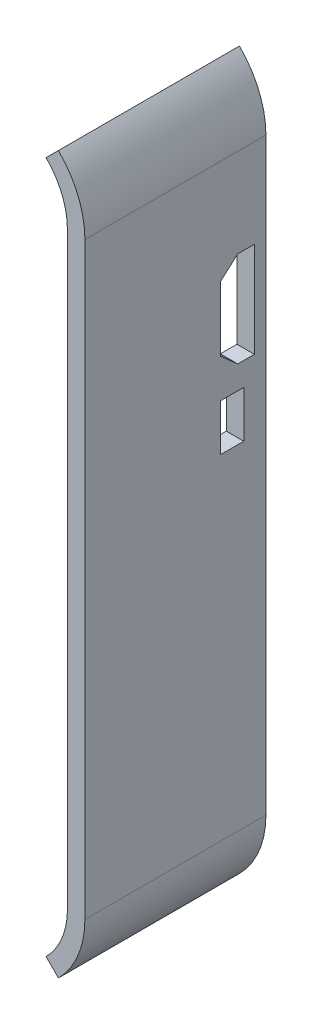
ISO-10303-21;
HEADER;
FILE_DESCRIPTION(('STEP AP214'),'2;1');
FILE_NAME('part.step','',(''),(''),'','','');
FILE_SCHEMA(('AUTOMOTIVE_DESIGN { 1 0 10303 214 1 1 1 1 }'));
ENDSEC;
DATA;
#1=APPLICATION_CONTEXT('core data for automotive mechanical design processes');
#2=APPLICATION_PROTOCOL_DEFINITION('international standard','automotive_design',2000,#1);
#3=PRODUCT_CONTEXT('',#1,'mechanical');
#4=PRODUCT('Part','Part','',(#3));
#5=PRODUCT_RELATED_PRODUCT_CATEGORY('part','',(#4));
#6=PRODUCT_DEFINITION_FORMATION('','',#4);
#7=PRODUCT_DEFINITION_CONTEXT('part definition',#1,'design');
#8=PRODUCT_DEFINITION('design','',#6,#7);
#9=PRODUCT_DEFINITION_SHAPE('','',#8);
#10=(LENGTH_UNIT() NAMED_UNIT(*) SI_UNIT(.MILLI.,.METRE.));
#11=(NAMED_UNIT(*) PLANE_ANGLE_UNIT() SI_UNIT($,.RADIAN.));
#12=(NAMED_UNIT(*) SI_UNIT($,.STERADIAN.) SOLID_ANGLE_UNIT());
#13=UNCERTAINTY_MEASURE_WITH_UNIT(LENGTH_MEASURE(1.E-05),#10,'distance_accuracy_value','');
#14=(GEOMETRIC_REPRESENTATION_CONTEXT(3) GLOBAL_UNCERTAINTY_ASSIGNED_CONTEXT((#13)) GLOBAL_UNIT_ASSIGNED_CONTEXT((#10,
#11,#12)) REPRESENTATION_CONTEXT('',''));
#15=CARTESIAN_POINT('',(0.,0.,0.));
#16=DIRECTION('',(0.,0.,1.));
#17=DIRECTION('',(1.,0.,0.));
#18=AXIS2_PLACEMENT_3D('',#15,#16,#17);
#19=CARTESIAN_POINT('',(21.4174971109602,36.9114971109601,-15.773));
#20=DIRECTION('',(0.,0.,1.));
#21=DIRECTION('',(-0.707106781186551,-0.707106781186544,0.));
#22=AXIS2_PLACEMENT_3D('',#19,#20,#21);
#23=PLANE('',#22);
#24=DIRECTION('',(-0.707106781186551,-0.707106781186544,0.));
#25=VECTOR('',#24,1.);
#26=CARTESIAN_POINT('',(15.7887485554801,31.28274855548,-15.773));
#27=LINE('',#26,#25);
#28=CARTESIAN_POINT('',(15.7277587950629,31.2217587950628,-15.773));
#29=VERTEX_POINT('',#28);
#30=CARTESIAN_POINT('',(14.6501280605346,30.1441280605345,-15.773));
#31=VERTEX_POINT('',#30);
#32=EDGE_CURVE('E266',#29,#31,#27,.T.);
#33=ORIENTED_EDGE('',*,*,#32,.F.);
#34=CARTESIAN_POINT('',(10.16,25.654,-15.773));
#35=DIRECTION('',(0.,0.,1.));
#36=DIRECTION('',(0.,-1.,0.));
#37=AXIS2_PLACEMENT_3D('',#34,#35,#36);
#38=CIRCLE('',#37,7.874);
#39=CARTESIAN_POINT('',(18.034,25.654,-15.773));
#40=VERTEX_POINT('',#39);
#41=EDGE_CURVE('E179',#29,#40,#38,.F.);
#42=ORIENTED_EDGE('',*,*,#41,.T.);
#43=DIRECTION('',(0.,1.,0.));
#44=VECTOR('',#43,1.);
#45=CARTESIAN_POINT('',(18.034,-25.654,-15.773));
#46=LINE('',#45,#44);
#47=CARTESIAN_POINT('',(18.034,-25.654,-15.773));
#48=VERTEX_POINT('',#47);
#49=EDGE_CURVE('E283',#48,#40,#46,.T.);
#50=ORIENTED_EDGE('',*,*,#49,.F.);
#51=CARTESIAN_POINT('',(10.16,-25.654,-15.773));
#52=DIRECTION('',(0.,0.,1.));
#53=DIRECTION('',(0.,-1.,0.));
#54=AXIS2_PLACEMENT_3D('',#51,#52,#53);
#55=CIRCLE('',#54,7.874);
#56=CARTESIAN_POINT('',(15.7277587950627,-31.221758795063,-15.773));
#57=VERTEX_POINT('',#56);
#58=EDGE_CURVE('E285',#57,#48,#55,.T.);
#59=ORIENTED_EDGE('',*,*,#58,.F.);
#60=DIRECTION('',(-0.70710678118653,0.707106781186565,0.));
#61=VECTOR('',#60,1.);
#62=CARTESIAN_POINT('',(14.6344099088336,-30.1284099088338,-15.773));
#63=LINE('',#62,#61);
#64=CARTESIAN_POINT('',(14.6501280605345,-30.1441280605347,-15.773));
#65=VERTEX_POINT('',#64);
#66=EDGE_CURVE('E40',#57,#65,#63,.T.);
#67=ORIENTED_EDGE('',*,*,#66,.T.);
#68=CARTESIAN_POINT('',(10.16,-25.654,-15.773));
#69=DIRECTION('',(0.,0.,-1.));
#70=DIRECTION('',(0.,1.,0.));
#71=AXIS2_PLACEMENT_3D('',#68,#69,#70);
#72=CIRCLE('',#71,6.35);
#73=CARTESIAN_POINT('',(16.51,-25.654,-15.773));
#74=VERTEX_POINT('',#73);
#75=EDGE_CURVE('E184',#65,#74,#72,.F.);
#76=ORIENTED_EDGE('',*,*,#75,.T.);
#77=DIRECTION('',(0.,1.,0.));
#78=VECTOR('',#77,1.);
#79=CARTESIAN_POINT('',(16.51,-25.654,-15.773));
#80=LINE('',#79,#78);
#81=CARTESIAN_POINT('',(16.51,25.654,-15.773));
#82=VERTEX_POINT('',#81);
#83=EDGE_CURVE('E180',#74,#82,#80,.T.);
#84=ORIENTED_EDGE('',*,*,#83,.T.);
#85=CARTESIAN_POINT('',(10.16,25.654,-15.773));
#86=DIRECTION('',(0.,0.,-1.));
#87=DIRECTION('',(0.,1.,0.));
#88=AXIS2_PLACEMENT_3D('',#85,#86,#87);
#89=CIRCLE('',#88,6.35);
#90=EDGE_CURVE('E168',#82,#31,#89,.F.);
#91=ORIENTED_EDGE('',*,*,#90,.T.);
#92=EDGE_LOOP('',(#33,#42,#50,#59,#67,#76,#84,#91));
#93=FACE_BOUND('',#92,.T.);
#94=ADVANCED_FACE('F36',(#93),#23,.F.);
#95=CARTESIAN_POINT('',(21.4174971109602,36.9114971109601,0.));
#96=DIRECTION('',(0.,0.,1.));
#97=DIRECTION('',(-0.707106781186551,-0.707106781186544,0.));
#98=AXIS2_PLACEMENT_3D('',#95,#96,#97);
#99=PLANE('',#98);
#100=DIRECTION('',(-0.707106781186551,-0.707106781186544,0.));
#101=VECTOR('',#100,1.);
#102=CARTESIAN_POINT('',(15.7887485554801,31.28274855548,0.));
#103=LINE('',#102,#101);
#104=CARTESIAN_POINT('',(15.7277587950629,31.2217587950628,0.));
#105=VERTEX_POINT('',#104);
#106=CARTESIAN_POINT('',(14.6501280605346,30.1441280605345,0.));
#107=VERTEX_POINT('',#106);
#108=EDGE_CURVE('E46',#105,#107,#103,.T.);
#109=ORIENTED_EDGE('',*,*,#108,.T.);
#110=CARTESIAN_POINT('',(10.16,25.654,0.));
#111=DIRECTION('',(0.,0.,1.));
#112=DIRECTION('',(-1.,0.,0.));
#113=AXIS2_PLACEMENT_3D('',#110,#111,#112);
#114=CIRCLE('',#113,6.35);
#115=CARTESIAN_POINT('',(16.51,25.654,0.));
#116=VERTEX_POINT('',#115);
#117=EDGE_CURVE('E193',#116,#107,#114,.T.);
#118=ORIENTED_EDGE('',*,*,#117,.F.);
#119=DIRECTION('',(0.,1.,0.));
#120=VECTOR('',#119,1.);
#121=CARTESIAN_POINT('',(16.51,-25.654,0.));
#122=LINE('',#121,#120);
#123=CARTESIAN_POINT('',(16.51,-25.654,0.));
#124=VERTEX_POINT('',#123);
#125=EDGE_CURVE('E191',#124,#116,#122,.T.);
#126=ORIENTED_EDGE('',*,*,#125,.F.);
#127=CARTESIAN_POINT('',(10.16,-25.654,0.));
#128=DIRECTION('',(0.,0.,1.));
#129=DIRECTION('',(1.,0.,0.));
#130=AXIS2_PLACEMENT_3D('',#127,#128,#129);
#131=CIRCLE('',#130,6.35);
#132=CARTESIAN_POINT('',(14.6501280605345,-30.1441280605347,0.));
#133=VERTEX_POINT('',#132);
#134=EDGE_CURVE('E273',#133,#124,#131,.T.);
#135=ORIENTED_EDGE('',*,*,#134,.F.);
#136=DIRECTION('',(-0.70710678118653,0.707106781186565,0.));
#137=VECTOR('',#136,1.);
#138=CARTESIAN_POINT('',(14.6344099088336,-30.1284099088338,0.));
#139=LINE('',#138,#137);
#140=CARTESIAN_POINT('',(15.7277587950627,-31.221758795063,0.));
#141=VERTEX_POINT('',#140);
#142=EDGE_CURVE('E11',#141,#133,#139,.T.);
#143=ORIENTED_EDGE('',*,*,#142,.F.);
#144=CARTESIAN_POINT('',(10.16,-25.654,0.));
#145=DIRECTION('',(0.,0.,1.));
#146=DIRECTION('',(1.,0.,0.));
#147=AXIS2_PLACEMENT_3D('',#144,#145,#146);
#148=CIRCLE('',#147,7.874);
#149=CARTESIAN_POINT('',(18.034,-25.654,0.));
#150=VERTEX_POINT('',#149);
#151=EDGE_CURVE('E291',#141,#150,#148,.T.);
#152=ORIENTED_EDGE('',*,*,#151,.T.);
#153=DIRECTION('',(0.,1.,0.));
#154=VECTOR('',#153,1.);
#155=CARTESIAN_POINT('',(18.034,-25.654,0.));
#156=LINE('',#155,#154);
#157=CARTESIAN_POINT('',(18.034,25.654,0.));
#158=VERTEX_POINT('',#157);
#159=EDGE_CURVE('E297',#150,#158,#156,.T.);
#160=ORIENTED_EDGE('',*,*,#159,.T.);
#161=CARTESIAN_POINT('',(10.16,25.654,0.));
#162=DIRECTION('',(0.,0.,1.));
#163=DIRECTION('',(1.,0.,0.));
#164=AXIS2_PLACEMENT_3D('',#161,#162,#163);
#165=CIRCLE('',#164,7.874);
#166=EDGE_CURVE('E281',#105,#158,#165,.F.);
#167=ORIENTED_EDGE('',*,*,#166,.F.);
#168=EDGE_LOOP('',(#109,#118,#126,#135,#143,#152,#160,#167));
#169=FACE_BOUND('',#168,.T.);
#170=ADVANCED_FACE('F315',(#169),#99,.T.);
#171=CARTESIAN_POINT('',(10.16,25.654,0.));
#172=DIRECTION('',(-0.707106781186544,0.707106781186551,0.));
#173=DIRECTION('',(-0.707106781186551,-0.707106781186544,0.));
#174=AXIS2_PLACEMENT_3D('',#171,#172,#173);
#175=PLANE('',#174);
#176=ORIENTED_EDGE('',*,*,#32,.T.);
#177=DIRECTION('',(0.,0.,1.));
#178=VECTOR('',#177,1.);
#179=CARTESIAN_POINT('',(14.6501280605346,30.1441280605345,-92.4217102672414));
#180=LINE('',#179,#178);
#181=EDGE_CURVE('E175',#31,#107,#180,.T.);
#182=ORIENTED_EDGE('',*,*,#181,.T.);
#183=ORIENTED_EDGE('',*,*,#108,.F.);
#184=DIRECTION('',(0.,0.,-1.));
#185=VECTOR('',#184,1.);
#186=CARTESIAN_POINT('',(15.7277587950629,31.2217587950628,1.27));
#187=LINE('',#186,#185);
#188=EDGE_CURVE('E277',#29,#105,#187,.F.);
#189=ORIENTED_EDGE('',*,*,#188,.F.);
#190=EDGE_LOOP('',(#176,#182,#183,#189));
#191=FACE_BOUND('',#190,.T.);
#192=ADVANCED_FACE('F318',(#191),#175,.T.);
#193=CARTESIAN_POINT('',(10.16,-25.654,0.));
#194=DIRECTION('',(-0.707106781186565,-0.70710678118653,0.));
#195=DIRECTION('',(0.70710678118653,-0.707106781186565,0.));
#196=AXIS2_PLACEMENT_3D('',#193,#194,#195);
#197=PLANE('',#196);
#198=ORIENTED_EDGE('',*,*,#142,.T.);
#199=DIRECTION('',(0.,0.,1.));
#200=VECTOR('',#199,1.);
#201=CARTESIAN_POINT('',(14.6501280605345,-30.1441280605347,-92.4217102672414));
#202=LINE('',#201,#200);
#203=EDGE_CURVE('E288',#133,#65,#202,.F.);
#204=ORIENTED_EDGE('',*,*,#203,.T.);
#205=ORIENTED_EDGE('',*,*,#66,.F.);
#206=DIRECTION('',(0.,0.,-1.));
#207=VECTOR('',#206,1.);
#208=CARTESIAN_POINT('',(15.7277587950627,-31.221758795063,1.27));
#209=LINE('',#208,#207);
#210=EDGE_CURVE('E294',#57,#141,#209,.F.);
#211=ORIENTED_EDGE('',*,*,#210,.T.);
#212=EDGE_LOOP('',(#198,#204,#205,#211));
#213=FACE_BOUND('',#212,.T.);
#214=ADVANCED_FACE('F310',(#213),#197,.T.);
#215=CARTESIAN_POINT('',(10.16,25.654,-92.4217102672414));
#216=DIRECTION('',(0.,0.,1.));
#217=DIRECTION('',(1.,0.,0.));
#218=AXIS2_PLACEMENT_3D('',#215,#216,#217);
#219=CYLINDRICAL_SURFACE('',#218,6.35);
#220=ORIENTED_EDGE('',*,*,#181,.F.);
#221=ORIENTED_EDGE('',*,*,#90,.F.);
#222=DIRECTION('',(0.,0.,1.));
#223=VECTOR('',#222,1.);
#224=CARTESIAN_POINT('',(16.51,25.654,-92.4217102672414));
#225=LINE('',#224,#223);
#226=EDGE_CURVE('E173',#82,#116,#225,.T.);
#227=ORIENTED_EDGE('',*,*,#226,.T.);
#228=ORIENTED_EDGE('',*,*,#117,.T.);
#229=EDGE_LOOP('',(#220,#221,#227,#228));
#230=FACE_BOUND('',#229,.T.);
#231=ADVANCED_FACE('F170',(#230),#219,.F.);
#232=CARTESIAN_POINT('',(10.16,-25.654,1.27));
#233=DIRECTION('',(0.,0.,-1.));
#234=DIRECTION('',(-1.,0.,0.));
#235=AXIS2_PLACEMENT_3D('',#232,#233,#234);
#236=CYLINDRICAL_SURFACE('',#235,7.874);
#237=ORIENTED_EDGE('',*,*,#151,.F.);
#238=ORIENTED_EDGE('',*,*,#210,.F.);
#239=ORIENTED_EDGE('',*,*,#58,.T.);
#240=DIRECTION('',(0.,0.,-1.));
#241=VECTOR('',#240,1.);
#242=CARTESIAN_POINT('',(18.034,-25.654,1.27));
#243=LINE('',#242,#241);
#244=EDGE_CURVE('E280',#150,#48,#243,.T.);
#245=ORIENTED_EDGE('',*,*,#244,.F.);
#246=EDGE_LOOP('',(#237,#238,#239,#245));
#247=FACE_BOUND('',#246,.T.);
#248=ADVANCED_FACE('F327',(#247),#236,.T.);
#249=CARTESIAN_POINT('',(-18.035,17.919,-13.3184293721233));
#250=DIRECTION('',(0.,0.747409318683659,0.66436383882992));
#251=DIRECTION('',(0.,-0.66436383882992,0.74740931868366));
#252=AXIS2_PLACEMENT_3D('',#249,#250,#251);
#253=PLANE('',#252);
#254=DIRECTION('',(0.,0.66436383882992,-0.747409318683659));
#255=VECTOR('',#254,1.);
#256=CARTESIAN_POINT('',(16.51,17.919,-13.3184293721233));
#257=LINE('',#256,#255);
#258=CARTESIAN_POINT('',(16.51,16.5790627803348,-11.811));
#259=VERTEX_POINT('',#258);
#260=CARTESIAN_POINT('',(16.51,17.919,-13.3184293721234));
#261=VERTEX_POINT('',#260);
#262=EDGE_CURVE('E233',#259,#261,#257,.T.);
#263=ORIENTED_EDGE('',*,*,#262,.T.);
#264=DIRECTION('',(1.,0.,0.));
#265=VECTOR('',#264,1.);
#266=CARTESIAN_POINT('',(-18.035,17.919,-13.3184293721233));
#267=LINE('',#266,#265);
#268=CARTESIAN_POINT('',(18.034,17.919,-13.3184293721233));
#269=VERTEX_POINT('',#268);
#270=EDGE_CURVE('E234',#261,#269,#267,.T.);
#271=ORIENTED_EDGE('',*,*,#270,.T.);
#272=DIRECTION('',(0.,-0.66436383882992,0.747409318683659));
#273=VECTOR('',#272,1.);
#274=CARTESIAN_POINT('',(18.034,17.919,-13.3184293721233));
#275=LINE('',#274,#273);
#276=CARTESIAN_POINT('',(18.034,16.5790627803348,-11.811));
#277=VERTEX_POINT('',#276);
#278=EDGE_CURVE('E257',#269,#277,#275,.T.);
#279=ORIENTED_EDGE('',*,*,#278,.T.);
#280=DIRECTION('',(1.,0.,0.));
#281=VECTOR('',#280,1.);
#282=CARTESIAN_POINT('',(-18.035,16.5790627803348,-11.811));
#283=LINE('',#282,#281);
#284=EDGE_CURVE('E236',#259,#277,#283,.T.);
#285=ORIENTED_EDGE('',*,*,#284,.F.);
#286=EDGE_LOOP('',(#263,#271,#279,#285));
#287=FACE_BOUND('',#286,.T.);
#288=ADVANCED_FACE('F329',(#287),#253,.F.);
#289=CARTESIAN_POINT('',(-18.035,16.5790627803348,-11.811));
#290=DIRECTION('',(0.,0.,1.));
#291=DIRECTION('',(1.,0.,0.));
#292=AXIS2_PLACEMENT_3D('',#289,#290,#291);
#293=PLANE('',#292);
#294=DIRECTION('',(0.,1.,0.));
#295=VECTOR('',#294,1.);
#296=CARTESIAN_POINT('',(16.51,16.5790627803348,-11.811));
#297=LINE('',#296,#295);
#298=CARTESIAN_POINT('',(16.51,10.9509372196652,-11.811));
#299=VERTEX_POINT('',#298);
#300=EDGE_CURVE('E244',#299,#259,#297,.T.);
#301=ORIENTED_EDGE('',*,*,#300,.T.);
#302=ORIENTED_EDGE('',*,*,#284,.T.);
#303=DIRECTION('',(0.,-1.,0.));
#304=VECTOR('',#303,1.);
#305=CARTESIAN_POINT('',(18.034,16.5790627803348,-11.811));
#306=LINE('',#305,#304);
#307=CARTESIAN_POINT('',(18.034,10.9509372196652,-11.811));
#308=VERTEX_POINT('',#307);
#309=EDGE_CURVE('E260',#277,#308,#306,.T.);
#310=ORIENTED_EDGE('',*,*,#309,.T.);
#311=DIRECTION('',(1.,0.,0.));
#312=VECTOR('',#311,1.);
#313=CARTESIAN_POINT('',(-18.035,10.9509372196652,-11.811));
#314=LINE('',#313,#312);
#315=EDGE_CURVE('E76',#299,#308,#314,.T.);
#316=ORIENTED_EDGE('',*,*,#315,.F.);
#317=EDGE_LOOP('',(#301,#302,#310,#316));
#318=FACE_BOUND('',#317,.T.);
#319=ADVANCED_FACE('F335',(#318),#293,.F.);
#320=CARTESIAN_POINT('',(-18.035,10.9509372196652,-11.811));
#321=DIRECTION('',(0.,-0.74740931868366,0.664363838829919));
#322=DIRECTION('',(0.,-0.66436383882992,-0.74740931868366));
#323=AXIS2_PLACEMENT_3D('',#320,#321,#322);
#324=PLANE('',#323);
#325=DIRECTION('',(0.,0.664363838829919,0.74740931868366));
#326=VECTOR('',#325,1.);
#327=CARTESIAN_POINT('',(16.51,10.9509372196652,-11.811));
#328=LINE('',#327,#326);
#329=CARTESIAN_POINT('',(16.51,9.61099999999998,-13.3184293721233));
#330=VERTEX_POINT('',#329);
#331=EDGE_CURVE('E246',#330,#299,#328,.T.);
#332=ORIENTED_EDGE('',*,*,#331,.T.);
#333=ORIENTED_EDGE('',*,*,#315,.T.);
#334=DIRECTION('',(0.,-0.664363838829919,-0.74740931868366));
#335=VECTOR('',#334,1.);
#336=CARTESIAN_POINT('',(18.034,10.9509372196652,-11.811));
#337=LINE('',#336,#335);
#338=CARTESIAN_POINT('',(18.034,9.61099999999998,-13.3184293721233));
#339=VERTEX_POINT('',#338);
#340=EDGE_CURVE('E262',#308,#339,#337,.T.);
#341=ORIENTED_EDGE('',*,*,#340,.T.);
#342=DIRECTION('',(1.,0.,0.));
#343=VECTOR('',#342,1.);
#344=CARTESIAN_POINT('',(-18.035,9.61099999999998,-13.3184293721233));
#345=LINE('',#344,#343);
#346=EDGE_CURVE('E240',#330,#339,#345,.T.);
#347=ORIENTED_EDGE('',*,*,#346,.F.);
#348=EDGE_LOOP('',(#332,#333,#341,#347));
#349=FACE_BOUND('',#348,.T.);
#350=ADVANCED_FACE('F370',(#349),#324,.F.);
#351=CARTESIAN_POINT('',(-18.035,9.61099999999998,-13.3184293721233));
#352=DIRECTION('',(0.,-1.,0.));
#353=DIRECTION('',(0.,0.,-1.));
#354=AXIS2_PLACEMENT_3D('',#351,#352,#353);
#355=PLANE('',#354);
#356=DIRECTION('',(0.,0.,1.));
#357=VECTOR('',#356,1.);
#358=CARTESIAN_POINT('',(16.51,9.61099999999998,-13.3184293721233));
#359=LINE('',#358,#357);
#360=CARTESIAN_POINT('',(16.51,9.61099999999998,-14.769));
#361=VERTEX_POINT('',#360);
#362=EDGE_CURVE('E248',#361,#330,#359,.T.);
#363=ORIENTED_EDGE('',*,*,#362,.T.);
#364=ORIENTED_EDGE('',*,*,#346,.T.);
#365=DIRECTION('',(0.,0.,-1.));
#366=VECTOR('',#365,1.);
#367=CARTESIAN_POINT('',(18.034,9.61099999999998,-13.3184293721233));
#368=LINE('',#367,#366);
#369=CARTESIAN_POINT('',(18.034,9.61099999999998,-14.769));
#370=VERTEX_POINT('',#369);
#371=EDGE_CURVE('E229',#339,#370,#368,.T.);
#372=ORIENTED_EDGE('',*,*,#371,.T.);
#373=DIRECTION('',(1.,0.,0.));
#374=VECTOR('',#373,1.);
#375=CARTESIAN_POINT('',(-18.035,9.61099999999998,-14.769));
#376=LINE('',#375,#374);
#377=EDGE_CURVE('E54',#361,#370,#376,.T.);
#378=ORIENTED_EDGE('',*,*,#377,.F.);
#379=EDGE_LOOP('',(#363,#364,#372,#378));
#380=FACE_BOUND('',#379,.T.);
#381=ADVANCED_FACE('F373',(#380),#355,.F.);
#382=CARTESIAN_POINT('',(-18.035,9.61099999999998,-14.769));
#383=DIRECTION('',(0.,0.,-1.));
#384=DIRECTION('',(-1.,0.,0.));
#385=AXIS2_PLACEMENT_3D('',#382,#383,#384);
#386=PLANE('',#385);
#387=DIRECTION('',(0.,-1.,0.));
#388=VECTOR('',#387,1.);
#389=CARTESIAN_POINT('',(16.51,9.61099999999998,-14.769));
#390=LINE('',#389,#388);
#391=CARTESIAN_POINT('',(16.51,17.919,-14.769));
#392=VERTEX_POINT('',#391);
#393=EDGE_CURVE('E250',#392,#361,#390,.T.);
#394=ORIENTED_EDGE('',*,*,#393,.T.);
#395=ORIENTED_EDGE('',*,*,#377,.T.);
#396=DIRECTION('',(0.,1.,0.));
#397=VECTOR('',#396,1.);
#398=CARTESIAN_POINT('',(18.034,9.61099999999998,-14.769));
#399=LINE('',#398,#397);
#400=CARTESIAN_POINT('',(18.034,17.919,-14.769));
#401=VERTEX_POINT('',#400);
#402=EDGE_CURVE('E237',#370,#401,#399,.T.);
#403=ORIENTED_EDGE('',*,*,#402,.T.);
#404=DIRECTION('',(1.,0.,0.));
#405=VECTOR('',#404,1.);
#406=CARTESIAN_POINT('',(-18.035,17.919,-14.769));
#407=LINE('',#406,#405);
#408=EDGE_CURVE('E230',#392,#401,#407,.T.);
#409=ORIENTED_EDGE('',*,*,#408,.F.);
#410=EDGE_LOOP('',(#394,#395,#403,#409));
#411=FACE_BOUND('',#410,.T.);
#412=ADVANCED_FACE('F365',(#411),#386,.F.);
#413=CARTESIAN_POINT('',(-18.035,17.919,-14.769));
#414=DIRECTION('',(0.,1.,0.));
#415=DIRECTION('',(0.,0.,1.));
#416=AXIS2_PLACEMENT_3D('',#413,#414,#415);
#417=PLANE('',#416);
#418=DIRECTION('',(0.,0.,-1.));
#419=VECTOR('',#418,1.);
#420=CARTESIAN_POINT('',(16.51,17.919,-14.769));
#421=LINE('',#420,#419);
#422=EDGE_CURVE('E252',#261,#392,#421,.T.);
#423=ORIENTED_EDGE('',*,*,#422,.T.);
#424=ORIENTED_EDGE('',*,*,#408,.T.);
#425=DIRECTION('',(0.,0.,1.));
#426=VECTOR('',#425,1.);
#427=CARTESIAN_POINT('',(18.034,17.919,-14.769));
#428=LINE('',#427,#426);
#429=EDGE_CURVE('E254',#401,#269,#428,.T.);
#430=ORIENTED_EDGE('',*,*,#429,.T.);
#431=ORIENTED_EDGE('',*,*,#270,.F.);
#432=EDGE_LOOP('',(#423,#424,#430,#431));
#433=FACE_BOUND('',#432,.T.);
#434=ADVANCED_FACE('F362',(#433),#417,.F.);
#435=CARTESIAN_POINT('',(-18.035,7.57899999999999,-13.843));
#436=DIRECTION('',(0.,0.,-1.));
#437=DIRECTION('',(-1.,0.,0.));
#438=AXIS2_PLACEMENT_3D('',#435,#436,#437);
#439=PLANE('',#438);
#440=DIRECTION('',(0.,-1.,0.));
#441=VECTOR('',#440,1.);
#442=CARTESIAN_POINT('',(16.51,7.57899999999998,-13.843));
#443=LINE('',#442,#441);
#444=CARTESIAN_POINT('',(16.51,7.57899999999998,-13.843));
#445=VERTEX_POINT('',#444);
#446=CARTESIAN_POINT('',(16.51,3.51499999999998,-13.843));
#447=VERTEX_POINT('',#446);
#448=EDGE_CURVE('E205',#445,#447,#443,.T.);
#449=ORIENTED_EDGE('',*,*,#448,.T.);
#450=DIRECTION('',(1.,0.,0.));
#451=VECTOR('',#450,1.);
#452=CARTESIAN_POINT('',(-18.035,3.51499999999999,-13.843));
#453=LINE('',#452,#451);
#454=CARTESIAN_POINT('',(18.034,3.51499999999998,-13.843));
#455=VERTEX_POINT('',#454);
#456=EDGE_CURVE('E207',#447,#455,#453,.T.);
#457=ORIENTED_EDGE('',*,*,#456,.T.);
#458=DIRECTION('',(0.,1.,0.));
#459=VECTOR('',#458,1.);
#460=CARTESIAN_POINT('',(18.034,7.57899999999998,-13.843));
#461=LINE('',#460,#459);
#462=CARTESIAN_POINT('',(18.034,7.57899999999998,-13.843));
#463=VERTEX_POINT('',#462);
#464=EDGE_CURVE('E196',#455,#463,#461,.T.);
#465=ORIENTED_EDGE('',*,*,#464,.T.);
#466=DIRECTION('',(1.,0.,0.));
#467=VECTOR('',#466,1.);
#468=CARTESIAN_POINT('',(-18.035,7.57899999999999,-13.843));
#469=LINE('',#468,#467);
#470=EDGE_CURVE('E209',#445,#463,#469,.T.);
#471=ORIENTED_EDGE('',*,*,#470,.F.);
#472=EDGE_LOOP('',(#449,#457,#465,#471));
#473=FACE_BOUND('',#472,.T.);
#474=ADVANCED_FACE('F364',(#473),#439,.F.);
#475=CARTESIAN_POINT('',(-18.035,7.57899999999999,-11.811));
#476=DIRECTION('',(0.,1.,0.));
#477=DIRECTION('',(0.,0.,1.));
#478=AXIS2_PLACEMENT_3D('',#475,#476,#477);
#479=PLANE('',#478);
#480=DIRECTION('',(0.,0.,-1.));
#481=VECTOR('',#480,1.);
#482=CARTESIAN_POINT('',(16.51,7.57899999999998,-11.811));
#483=LINE('',#482,#481);
#484=CARTESIAN_POINT('',(16.51,7.57899999999998,-11.811));
#485=VERTEX_POINT('',#484);
#486=EDGE_CURVE('E214',#485,#445,#483,.T.);
#487=ORIENTED_EDGE('',*,*,#486,.T.);
#488=ORIENTED_EDGE('',*,*,#470,.T.);
#489=DIRECTION('',(0.,0.,1.));
#490=VECTOR('',#489,1.);
#491=CARTESIAN_POINT('',(18.034,7.57899999999998,-11.811));
#492=LINE('',#491,#490);
#493=CARTESIAN_POINT('',(18.034,7.57899999999998,-11.811));
#494=VERTEX_POINT('',#493);
#495=EDGE_CURVE('E192',#463,#494,#492,.T.);
#496=ORIENTED_EDGE('',*,*,#495,.T.);
#497=DIRECTION('',(1.,0.,0.));
#498=VECTOR('',#497,1.);
#499=CARTESIAN_POINT('',(-18.035,7.57899999999999,-11.811));
#500=LINE('',#499,#498);
#501=EDGE_CURVE('E206',#485,#494,#500,.T.);
#502=ORIENTED_EDGE('',*,*,#501,.F.);
#503=EDGE_LOOP('',(#487,#488,#496,#502));
#504=FACE_BOUND('',#503,.T.);
#505=ADVANCED_FACE('F385',(#504),#479,.F.);
#506=CARTESIAN_POINT('',(-18.035,7.57899999999999,-11.811));
#507=DIRECTION('',(0.,0.,1.));
#508=DIRECTION('',(1.,0.,0.));
#509=AXIS2_PLACEMENT_3D('',#506,#507,#508);
#510=PLANE('',#509);
#511=DIRECTION('',(0.,1.,0.));
#512=VECTOR('',#511,1.);
#513=CARTESIAN_POINT('',(16.51,7.57899999999998,-11.811));
#514=LINE('',#513,#512);
#515=CARTESIAN_POINT('',(16.51,3.51499999999998,-11.811));
#516=VERTEX_POINT('',#515);
#517=EDGE_CURVE('E217',#516,#485,#514,.T.);
#518=ORIENTED_EDGE('',*,*,#517,.T.);
#519=ORIENTED_EDGE('',*,*,#501,.T.);
#520=DIRECTION('',(0.,-1.,0.));
#521=VECTOR('',#520,1.);
#522=CARTESIAN_POINT('',(18.034,7.57899999999998,-11.811));
#523=LINE('',#522,#521);
#524=CARTESIAN_POINT('',(18.034,3.51499999999998,-11.811));
#525=VERTEX_POINT('',#524);
#526=EDGE_CURVE('E210',#494,#525,#523,.T.);
#527=ORIENTED_EDGE('',*,*,#526,.T.);
#528=DIRECTION('',(1.,0.,0.));
#529=VECTOR('',#528,1.);
#530=CARTESIAN_POINT('',(-18.035,3.51499999999999,-11.811));
#531=LINE('',#530,#529);
#532=EDGE_CURVE('E202',#516,#525,#531,.T.);
#533=ORIENTED_EDGE('',*,*,#532,.F.);
#534=EDGE_LOOP('',(#518,#519,#527,#533));
#535=FACE_BOUND('',#534,.T.);
#536=ADVANCED_FACE('F381',(#535),#510,.F.);
#537=CARTESIAN_POINT('',(-18.035,3.51499999999999,-11.811));
#538=DIRECTION('',(0.,-1.,0.));
#539=DIRECTION('',(1.,0.,0.));
#540=AXIS2_PLACEMENT_3D('',#537,#538,#539);
#541=PLANE('',#540);
#542=DIRECTION('',(0.,0.,1.));
#543=VECTOR('',#542,1.);
#544=CARTESIAN_POINT('',(16.51,3.51499999999998,-11.811));
#545=LINE('',#544,#543);
#546=EDGE_CURVE('E220',#447,#516,#545,.T.);
#547=ORIENTED_EDGE('',*,*,#546,.T.);
#548=ORIENTED_EDGE('',*,*,#532,.T.);
#549=DIRECTION('',(0.,0.,-1.));
#550=VECTOR('',#549,1.);
#551=CARTESIAN_POINT('',(18.034,3.51499999999998,-11.811));
#552=LINE('',#551,#550);
#553=EDGE_CURVE('E222',#525,#455,#552,.T.);
#554=ORIENTED_EDGE('',*,*,#553,.T.);
#555=ORIENTED_EDGE('',*,*,#456,.F.);
#556=EDGE_LOOP('',(#547,#548,#554,#555));
#557=FACE_BOUND('',#556,.T.);
#558=ADVANCED_FACE('F378',(#557),#541,.F.);
#559=CARTESIAN_POINT('',(18.034,-25.654,1.27));
#560=DIRECTION('',(-1.,0.,0.));
#561=DIRECTION('',(0.,-1.,0.));
#562=AXIS2_PLACEMENT_3D('',#559,#560,#561);
#563=PLANE('',#562);
#564=ORIENTED_EDGE('',*,*,#553,.F.);
#565=ORIENTED_EDGE('',*,*,#526,.F.);
#566=ORIENTED_EDGE('',*,*,#495,.F.);
#567=ORIENTED_EDGE('',*,*,#464,.F.);
#568=EDGE_LOOP('',(#564,#565,#566,#567));
#569=FACE_BOUND('',#568,.T.);
#570=ORIENTED_EDGE('',*,*,#429,.F.);
#571=ORIENTED_EDGE('',*,*,#402,.F.);
#572=ORIENTED_EDGE('',*,*,#371,.F.);
#573=ORIENTED_EDGE('',*,*,#340,.F.);
#574=ORIENTED_EDGE('',*,*,#309,.F.);
#575=ORIENTED_EDGE('',*,*,#278,.F.);
#576=EDGE_LOOP('',(#570,#571,#572,#573,#574,#575));
#577=FACE_BOUND('',#576,.T.);
#578=ORIENTED_EDGE('',*,*,#159,.F.);
#579=ORIENTED_EDGE('',*,*,#244,.T.);
#580=ORIENTED_EDGE('',*,*,#49,.T.);
#581=DIRECTION('',(0.,0.,-1.));
#582=VECTOR('',#581,1.);
#583=CARTESIAN_POINT('',(18.034,25.654,1.27));
#584=LINE('',#583,#582);
#585=EDGE_CURVE('E276',#158,#40,#584,.T.);
#586=ORIENTED_EDGE('',*,*,#585,.F.);
#587=EDGE_LOOP('',(#578,#579,#580,#586));
#588=FACE_BOUND('',#587,.T.);
#589=ADVANCED_FACE('F324',(#569,#577,#588),#563,.F.);
#590=CARTESIAN_POINT('',(10.16,25.654,1.27));
#591=DIRECTION('',(0.,0.,-1.));
#592=DIRECTION('',(-1.,0.,0.));
#593=AXIS2_PLACEMENT_3D('',#590,#591,#592);
#594=CYLINDRICAL_SURFACE('',#593,7.874);
#595=ORIENTED_EDGE('',*,*,#188,.T.);
#596=ORIENTED_EDGE('',*,*,#166,.T.);
#597=ORIENTED_EDGE('',*,*,#585,.T.);
#598=ORIENTED_EDGE('',*,*,#41,.F.);
#599=EDGE_LOOP('',(#595,#596,#597,#598));
#600=FACE_BOUND('',#599,.T.);
#601=ADVANCED_FACE('F38',(#600),#594,.T.);
#602=CARTESIAN_POINT('',(16.51,-25.654,-92.4217102672414));
#603=DIRECTION('',(1.,0.,0.));
#604=DIRECTION('',(0.,1.,0.));
#605=AXIS2_PLACEMENT_3D('',#602,#603,#604);
#606=PLANE('',#605);
#607=ORIENTED_EDGE('',*,*,#362,.F.);
#608=ORIENTED_EDGE('',*,*,#393,.F.);
#609=ORIENTED_EDGE('',*,*,#422,.F.);
#610=ORIENTED_EDGE('',*,*,#262,.F.);
#611=ORIENTED_EDGE('',*,*,#300,.F.);
#612=ORIENTED_EDGE('',*,*,#331,.F.);
#613=EDGE_LOOP('',(#607,#608,#609,#610,#611,#612));
#614=FACE_BOUND('',#613,.T.);
#615=ORIENTED_EDGE('',*,*,#486,.F.);
#616=ORIENTED_EDGE('',*,*,#517,.F.);
#617=ORIENTED_EDGE('',*,*,#546,.F.);
#618=ORIENTED_EDGE('',*,*,#448,.F.);
#619=EDGE_LOOP('',(#615,#616,#617,#618));
#620=FACE_BOUND('',#619,.T.);
#621=ORIENTED_EDGE('',*,*,#83,.F.);
#622=DIRECTION('',(0.,0.,1.));
#623=VECTOR('',#622,1.);
#624=CARTESIAN_POINT('',(16.51,-25.654,-92.4217102672414));
#625=LINE('',#624,#623);
#626=EDGE_CURVE('E198',#74,#124,#625,.T.);
#627=ORIENTED_EDGE('',*,*,#626,.T.);
#628=ORIENTED_EDGE('',*,*,#125,.T.);
#629=ORIENTED_EDGE('',*,*,#226,.F.);
#630=EDGE_LOOP('',(#621,#627,#628,#629));
#631=FACE_BOUND('',#630,.T.);
#632=ADVANCED_FACE('F190',(#614,#620,#631),#606,.F.);
#633=CARTESIAN_POINT('',(10.16,-25.654,-92.4217102672414));
#634=DIRECTION('',(0.,0.,1.));
#635=DIRECTION('',(1.,0.,0.));
#636=AXIS2_PLACEMENT_3D('',#633,#634,#635);
#637=CYLINDRICAL_SURFACE('',#636,6.35);
#638=ORIENTED_EDGE('',*,*,#203,.F.);
#639=ORIENTED_EDGE('',*,*,#134,.T.);
#640=ORIENTED_EDGE('',*,*,#626,.F.);
#641=ORIENTED_EDGE('',*,*,#75,.F.);
#642=EDGE_LOOP('',(#638,#639,#640,#641));
#643=FACE_BOUND('',#642,.T.);
#644=ADVANCED_FACE('F313',(#643),#637,.F.);
#645=CLOSED_SHELL('',(#94,#170,#192,#214,#231,#248,#288,#319,#350,#381,#412,#434,#474,#505,#536,
#558,#589,#601,#632,#644));
#646=MANIFOLD_SOLID_BREP('B2',#645);
#647=ADVANCED_BREP_SHAPE_REPRESENTATION('',(#18,#646),#14);
#648=SHAPE_DEFINITION_REPRESENTATION(#9,#647);
ENDSEC;
END-ISO-10303-21;
